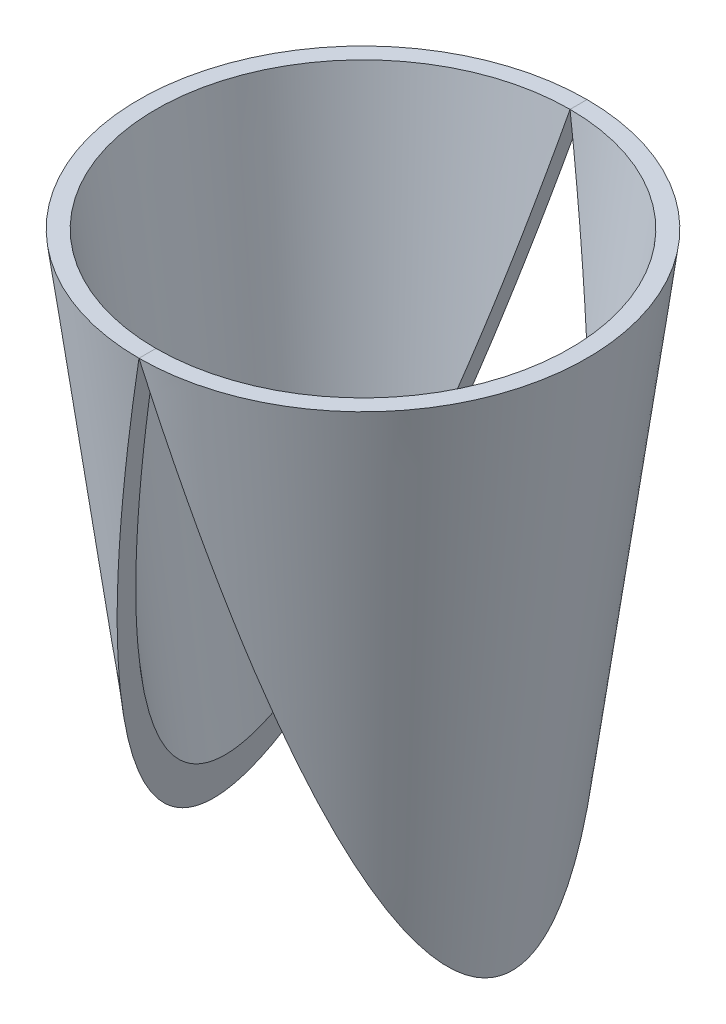
ISO-10303-21;
HEADER;
FILE_DESCRIPTION(('STEP AP214'),'2;1');
FILE_NAME('part.step','',(''),(''),'','','');
FILE_SCHEMA(('AUTOMOTIVE_DESIGN { 1 0 10303 214 1 1 1 1 }'));
ENDSEC;
DATA;
#1=APPLICATION_CONTEXT('core data for automotive mechanical design processes');
#2=APPLICATION_PROTOCOL_DEFINITION('international standard','automotive_design',2000,#1);
#3=PRODUCT_CONTEXT('',#1,'mechanical');
#4=PRODUCT('Part','Part','',(#3));
#5=PRODUCT_RELATED_PRODUCT_CATEGORY('part','',(#4));
#6=PRODUCT_DEFINITION_FORMATION('','',#4);
#7=PRODUCT_DEFINITION_CONTEXT('part definition',#1,'design');
#8=PRODUCT_DEFINITION('design','',#6,#7);
#9=PRODUCT_DEFINITION_SHAPE('','',#8);
#10=(LENGTH_UNIT() NAMED_UNIT(*) SI_UNIT(.MILLI.,.METRE.));
#11=(NAMED_UNIT(*) PLANE_ANGLE_UNIT() SI_UNIT($,.RADIAN.));
#12=(NAMED_UNIT(*) SI_UNIT($,.STERADIAN.) SOLID_ANGLE_UNIT());
#13=UNCERTAINTY_MEASURE_WITH_UNIT(LENGTH_MEASURE(1.E-05),#10,'distance_accuracy_value','');
#14=(GEOMETRIC_REPRESENTATION_CONTEXT(3) GLOBAL_UNCERTAINTY_ASSIGNED_CONTEXT((#13)) GLOBAL_UNIT_ASSIGNED_CONTEXT((#10,
#11,#12)) REPRESENTATION_CONTEXT('',''));
#15=CARTESIAN_POINT('',(0.,0.,0.));
#16=DIRECTION('',(0.,0.,1.));
#17=DIRECTION('',(1.,0.,0.));
#18=AXIS2_PLACEMENT_3D('',#15,#16,#17);
#19=CARTESIAN_POINT('',(-1.32642552543948E-13,0.,0.));
#20=DIRECTION('',(0.,1.,0.));
#21=DIRECTION('',(-1.,0.,0.));
#22=AXIS2_PLACEMENT_3D('',#19,#20,#21);
#23=CONICAL_SURFACE('',#22,47.6250000000001,0.130827396074058);
#24=CARTESIAN_POINT('',(31.7499999999999,120.65,0.));
#25=DIRECTION('',(-0.967074537262646,0.254493299279644,0.));
#26=DIRECTION('',(0.254493299279644,0.967074537262646,0.));
#27=AXIS2_PLACEMENT_3D('',#24,#25,#26);
#28=ELLIPSE('',#27,249.515410345733,54.9926131403119);
#29=CARTESIAN_POINT('',(0.,0.,47.6250000000001));
#30=VERTEX_POINT('',#29);
#31=CARTESIAN_POINT('',(0.,0.,-47.6250000000001));
#32=VERTEX_POINT('',#31);
#33=EDGE_CURVE('E68',#30,#32,#28,.F.);
#34=ORIENTED_EDGE('',*,*,#33,.F.);
#35=CARTESIAN_POINT('',(-1.32642552543948E-13,0.,0.));
#36=DIRECTION('',(0.,1.,0.));
#37=DIRECTION('',(-1.,0.,0.));
#38=AXIS2_PLACEMENT_3D('',#35,#36,#37);
#39=CIRCLE('',#38,47.6250000000001);
#40=EDGE_CURVE('E76',#32,#30,#39,.T.);
#41=ORIENTED_EDGE('',*,*,#40,.F.);
#42=EDGE_LOOP('',(#34,#41));
#43=FACE_BOUND('',#42,.T.);
#44=ADVANCED_FACE('F44',(#43),#23,.T.);
#45=CARTESIAN_POINT('',(0.,0.,0.));
#46=DIRECTION('',(0.,1.,0.));
#47=DIRECTION('',(-1.,0.,0.));
#48=AXIS2_PLACEMENT_3D('',#45,#46,#47);
#49=PLANE('',#48);
#50=ORIENTED_EDGE('',*,*,#40,.T.);
#51=DIRECTION('',(0.,0.,1.));
#52=VECTOR('',#51,1.);
#53=CARTESIAN_POINT('',(0.,0.,-47.6250000000001));
#54=LINE('',#53,#52);
#55=CARTESIAN_POINT('',(0.,0.,44.0170524155879));
#56=VERTEX_POINT('',#55);
#57=EDGE_CURVE('E12',#56,#30,#54,.T.);
#58=ORIENTED_EDGE('',*,*,#57,.F.);
#59=CARTESIAN_POINT('',(-1.32642552543948E-13,0.,0.));
#60=DIRECTION('',(0.,1.,0.));
#61=DIRECTION('',(-1.,0.,0.));
#62=AXIS2_PLACEMENT_3D('',#59,#60,#61);
#63=CIRCLE('',#62,44.0170524155877);
#64=CARTESIAN_POINT('',(0.,0.,-44.0170524155878));
#65=VERTEX_POINT('',#64);
#66=EDGE_CURVE('E47',#65,#56,#63,.T.);
#67=ORIENTED_EDGE('',*,*,#66,.F.);
#68=EDGE_CURVE('E53',#32,#65,#54,.T.);
#69=ORIENTED_EDGE('',*,*,#68,.F.);
#70=EDGE_LOOP('',(#50,#58,#67,#69));
#71=FACE_BOUND('',#70,.T.);
#72=ADVANCED_FACE('F75',(#71),#49,.T.);
#73=CARTESIAN_POINT('',(-1.32642552543948E-13,0.,0.));
#74=DIRECTION('',(0.,1.,0.));
#75=DIRECTION('',(-1.,0.,0.));
#76=AXIS2_PLACEMENT_3D('',#73,#74,#75);
#77=CONICAL_SURFACE('',#76,44.0170524155877,0.13082739607406);
#78=ORIENTED_EDGE('',*,*,#66,.T.);
#79=CARTESIAN_POINT('',(29.3447016103922,111.50986611949,0.));
#80=DIRECTION('',(-0.967074537262646,0.254493299279644,0.));
#81=DIRECTION('',(0.254493299279644,0.967074537262646,0.));
#82=AXIS2_PLACEMENT_3D('',#79,#80,#81);
#83=ELLIPSE('',#82,230.61276421386,50.826514122147);
#84=EDGE_CURVE('E72',#56,#65,#83,.F.);
#85=ORIENTED_EDGE('',*,*,#84,.T.);
#86=EDGE_LOOP('',(#78,#85));
#87=FACE_BOUND('',#86,.T.);
#88=ADVANCED_FACE('F81',(#87),#77,.F.);
#89=CARTESIAN_POINT('',(0.,0.,-47.6250000000001));
#90=DIRECTION('',(-0.967074537262646,0.254493299279644,0.));
#91=DIRECTION('',(-0.254493299279644,-0.967074537262647,0.));
#92=AXIS2_PLACEMENT_3D('',#89,#90,#91);
#93=PLANE('',#92);
#94=ORIENTED_EDGE('',*,*,#33,.T.);
#95=ORIENTED_EDGE('',*,*,#68,.T.);
#96=ORIENTED_EDGE('',*,*,#84,.F.);
#97=ORIENTED_EDGE('',*,*,#57,.T.);
#98=EDGE_LOOP('',(#94,#95,#96,#97));
#99=FACE_BOUND('',#98,.T.);
#100=ADVANCED_FACE('F69',(#99),#93,.F.);
#101=CLOSED_SHELL('',(#44,#72,#88,#100));
#102=MANIFOLD_SOLID_BREP('B2',#101);
#103=CARTESIAN_POINT('',(-1.32642552543948E-13,0.,0.));
#104=DIRECTION('',(0.,1.,0.));
#105=DIRECTION('',(-1.,0.,0.));
#106=AXIS2_PLACEMENT_3D('',#103,#104,#105);
#107=CONICAL_SURFACE('',#106,44.0170524155877,0.13082739607406);
#108=CARTESIAN_POINT('',(-1.32642552543948E-13,0.,0.));
#109=DIRECTION('',(0.,1.,0.));
#110=DIRECTION('',(-1.,0.,0.));
#111=AXIS2_PLACEMENT_3D('',#108,#109,#110);
#112=CIRCLE('',#111,44.0170524155877);
#113=CARTESIAN_POINT('',(0.,0.,44.0170524155878));
#114=VERTEX_POINT('',#113);
#115=CARTESIAN_POINT('',(0.,0.,-44.0170524155879));
#116=VERTEX_POINT('',#115);
#117=EDGE_CURVE('E142',#114,#116,#112,.T.);
#118=ORIENTED_EDGE('',*,*,#117,.T.);
#119=CARTESIAN_POINT('',(-29.3447016103935,111.509866119495,0.));
#120=DIRECTION('',(0.967074537262646,0.254493299279644,0.));
#121=DIRECTION('',(-0.254493299279644,0.967074537262646,0.));
#122=AXIS2_PLACEMENT_3D('',#119,#120,#121);
#123=ELLIPSE('',#122,230.612764213866,50.8265141221475);
#124=EDGE_CURVE('E149',#116,#114,#123,.F.);
#125=ORIENTED_EDGE('',*,*,#124,.T.);
#126=EDGE_LOOP('',(#118,#125));
#127=FACE_BOUND('',#126,.T.);
#128=ADVANCED_FACE('F115',(#127),#107,.F.);
#129=CARTESIAN_POINT('',(0.,0.,0.));
#130=DIRECTION('',(0.,1.,0.));
#131=DIRECTION('',(-1.,0.,0.));
#132=AXIS2_PLACEMENT_3D('',#129,#130,#131);
#133=PLANE('',#132);
#134=DIRECTION('',(0.,0.,-1.));
#135=VECTOR('',#134,1.);
#136=CARTESIAN_POINT('',(0.,0.,0.));
#137=LINE('',#136,#135);
#138=CARTESIAN_POINT('',(0.,0.,47.6250000000001));
#139=VERTEX_POINT('',#138);
#140=EDGE_CURVE('E123',#139,#114,#137,.T.);
#141=ORIENTED_EDGE('',*,*,#140,.F.);
#142=CARTESIAN_POINT('',(-1.32642552543948E-13,0.,0.));
#143=DIRECTION('',(0.,1.,0.));
#144=DIRECTION('',(-1.,0.,0.));
#145=AXIS2_PLACEMENT_3D('',#142,#143,#144);
#146=CIRCLE('',#145,47.6250000000001);
#147=CARTESIAN_POINT('',(0.,0.,-47.6250000000001));
#148=VERTEX_POINT('',#147);
#149=EDGE_CURVE('E146',#139,#148,#146,.T.);
#150=ORIENTED_EDGE('',*,*,#149,.T.);
#151=EDGE_CURVE('E42',#116,#148,#137,.T.);
#152=ORIENTED_EDGE('',*,*,#151,.F.);
#153=ORIENTED_EDGE('',*,*,#117,.F.);
#154=EDGE_LOOP('',(#141,#150,#152,#153));
#155=FACE_BOUND('',#154,.T.);
#156=ADVANCED_FACE('F145',(#155),#133,.T.);
#157=CARTESIAN_POINT('',(-1.32642552543948E-13,0.,0.));
#158=DIRECTION('',(0.,1.,0.));
#159=DIRECTION('',(-1.,0.,0.));
#160=AXIS2_PLACEMENT_3D('',#157,#158,#159);
#161=CONICAL_SURFACE('',#160,47.6250000000001,0.130827396074058);
#162=CARTESIAN_POINT('',(-31.7500000000013,120.650000000005,0.));
#163=DIRECTION('',(0.967074537262646,0.254493299279644,0.));
#164=DIRECTION('',(-0.254493299279644,0.967074537262646,0.));
#165=AXIS2_PLACEMENT_3D('',#162,#163,#164);
#166=ELLIPSE('',#165,249.51541034574,54.9926131403125);
#167=EDGE_CURVE('E138',#148,#139,#166,.F.);
#168=ORIENTED_EDGE('',*,*,#167,.F.);
#169=ORIENTED_EDGE('',*,*,#149,.F.);
#170=EDGE_LOOP('',(#168,#169));
#171=FACE_BOUND('',#170,.T.);
#172=ADVANCED_FACE('F117',(#171),#161,.T.);
#173=CARTESIAN_POINT('',(31.75,-120.65,-47.6250000000001));
#174=DIRECTION('',(0.967074537262646,0.254493299279644,0.));
#175=DIRECTION('',(-0.254493299279644,0.967074537262646,0.));
#176=AXIS2_PLACEMENT_3D('',#173,#174,#175);
#177=PLANE('',#176);
#178=ORIENTED_EDGE('',*,*,#167,.T.);
#179=ORIENTED_EDGE('',*,*,#140,.T.);
#180=ORIENTED_EDGE('',*,*,#124,.F.);
#181=ORIENTED_EDGE('',*,*,#151,.T.);
#182=EDGE_LOOP('',(#178,#179,#180,#181));
#183=FACE_BOUND('',#182,.T.);
#184=ADVANCED_FACE('F139',(#183),#177,.F.);
#185=CLOSED_SHELL('',(#128,#156,#172,#184));
#186=MANIFOLD_SOLID_BREP('B6',#185);
#187=ADVANCED_BREP_SHAPE_REPRESENTATION('',(#18,#102,#186),#14);
#188=SHAPE_DEFINITION_REPRESENTATION(#9,#187);
ENDSEC;
END-ISO-10303-21;
